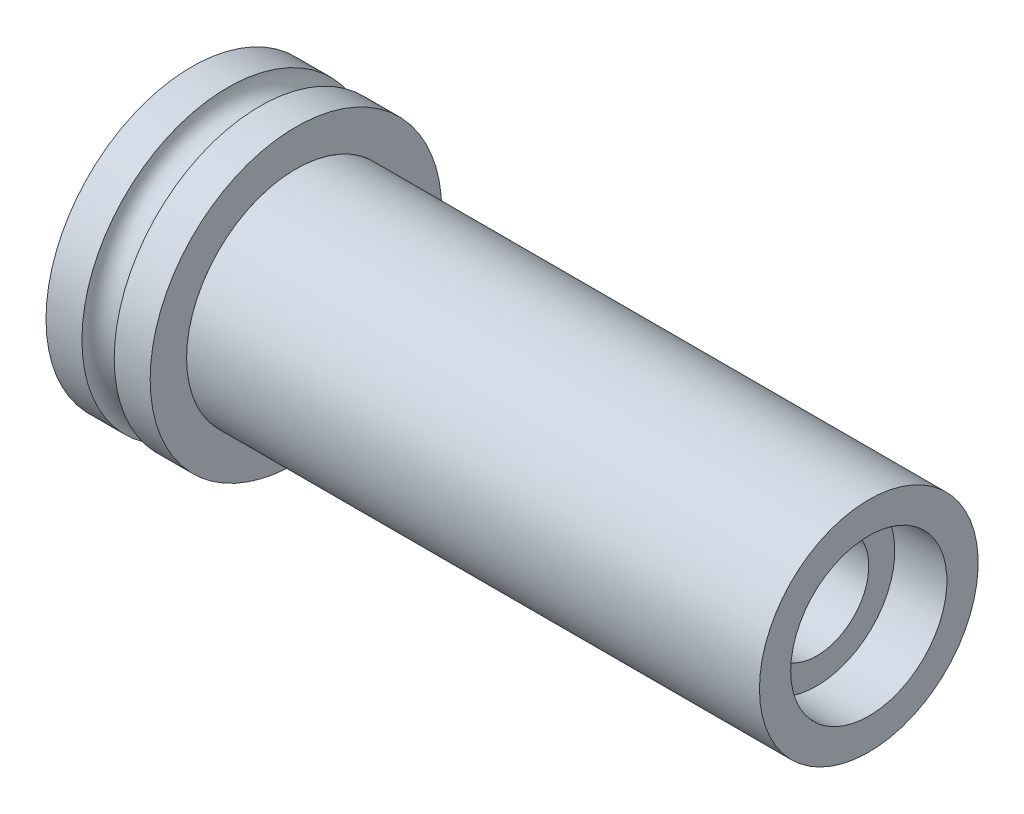
ISO-10303-21;
HEADER;
FILE_DESCRIPTION(('STEP AP214'),'2;1');
FILE_NAME('part.step','',(''),(''),'','','');
FILE_SCHEMA(('AUTOMOTIVE_DESIGN { 1 0 10303 214 1 1 1 1 }'));
ENDSEC;
DATA;
#1=APPLICATION_CONTEXT('core data for automotive mechanical design processes');
#2=APPLICATION_PROTOCOL_DEFINITION('international standard','automotive_design',2000,#1);
#3=PRODUCT_CONTEXT('',#1,'mechanical');
#4=PRODUCT('Part','Part','',(#3));
#5=PRODUCT_RELATED_PRODUCT_CATEGORY('part','',(#4));
#6=PRODUCT_DEFINITION_FORMATION('','',#4);
#7=PRODUCT_DEFINITION_CONTEXT('part definition',#1,'design');
#8=PRODUCT_DEFINITION('design','',#6,#7);
#9=PRODUCT_DEFINITION_SHAPE('','',#8);
#10=(LENGTH_UNIT() NAMED_UNIT(*) SI_UNIT(.MILLI.,.METRE.));
#11=(NAMED_UNIT(*) PLANE_ANGLE_UNIT() SI_UNIT($,.RADIAN.));
#12=(NAMED_UNIT(*) SI_UNIT($,.STERADIAN.) SOLID_ANGLE_UNIT());
#13=UNCERTAINTY_MEASURE_WITH_UNIT(LENGTH_MEASURE(1.E-05),#10,'distance_accuracy_value','');
#14=(GEOMETRIC_REPRESENTATION_CONTEXT(3) GLOBAL_UNCERTAINTY_ASSIGNED_CONTEXT((#13)) GLOBAL_UNIT_ASSIGNED_CONTEXT((#10,
#11,#12)) REPRESENTATION_CONTEXT('',''));
#15=CARTESIAN_POINT('',(0.,0.,0.));
#16=DIRECTION('',(0.,0.,1.));
#17=DIRECTION('',(1.,0.,0.));
#18=AXIS2_PLACEMENT_3D('',#15,#16,#17);
#19=CARTESIAN_POINT('',(-37.5,0.,0.));
#20=DIRECTION('',(1.,0.,0.));
#21=DIRECTION('',(0.,0.,-1.));
#22=AXIS2_PLACEMENT_3D('',#19,#20,#21);
#23=CYLINDRICAL_SURFACE('',#22,14.);
#24=CARTESIAN_POINT('',(-37.5,0.,0.));
#25=DIRECTION('',(1.,0.,0.));
#26=DIRECTION('',(0.,0.,-1.));
#27=AXIS2_PLACEMENT_3D('',#24,#25,#26);
#28=CIRCLE('',#27,14.);
#29=CARTESIAN_POINT('',(-37.5,0.,-14.));
#30=VERTEX_POINT('',#29);
#31=EDGE_CURVE('E11',#30,#30,#28,.T.);
#32=ORIENTED_EDGE('',*,*,#31,.T.);
#33=EDGE_LOOP('',(#32));
#34=FACE_BOUND('',#33,.T.);
#35=CARTESIAN_POINT('',(-34.05,0.,0.));
#36=DIRECTION('',(1.,0.,0.));
#37=DIRECTION('',(0.,0.,-1.));
#38=AXIS2_PLACEMENT_3D('',#35,#36,#37);
#39=CIRCLE('',#38,14.);
#40=CARTESIAN_POINT('',(-34.05,0.,-14.));
#41=VERTEX_POINT('',#40);
#42=EDGE_CURVE('E48',#41,#41,#39,.F.);
#43=ORIENTED_EDGE('',*,*,#42,.T.);
#44=EDGE_LOOP('',(#43));
#45=FACE_BOUND('',#44,.T.);
#46=ADVANCED_FACE('F45',(#34,#45),#23,.T.);
#47=CARTESIAN_POINT('',(-27.5,0.,0.));
#48=DIRECTION('',(1.,0.,0.));
#49=DIRECTION('',(0.,0.,-1.));
#50=AXIS2_PLACEMENT_3D('',#47,#48,#49);
#51=CIRCLE('',#50,14.);
#52=CARTESIAN_POINT('',(-27.5,0.,-14.));
#53=VERTEX_POINT('',#52);
#54=EDGE_CURVE('E52',#53,#53,#51,.T.);
#55=ORIENTED_EDGE('',*,*,#54,.F.);
#56=EDGE_LOOP('',(#55));
#57=FACE_BOUND('',#56,.T.);
#58=CARTESIAN_POINT('',(-30.95,0.,0.));
#59=DIRECTION('',(-1.,0.,0.));
#60=DIRECTION('',(0.,0.,1.));
#61=AXIS2_PLACEMENT_3D('',#58,#59,#60);
#62=CIRCLE('',#61,14.);
#63=CARTESIAN_POINT('',(-30.95,0.,14.));
#64=VERTEX_POINT('',#63);
#65=EDGE_CURVE('E62',#64,#64,#62,.F.);
#66=ORIENTED_EDGE('',*,*,#65,.T.);
#67=EDGE_LOOP('',(#66));
#68=FACE_BOUND('',#67,.T.);
#69=ADVANCED_FACE('F92',(#57,#68),#23,.T.);
#70=CARTESIAN_POINT('',(-37.5,0.,0.));
#71=DIRECTION('',(1.,0.,0.));
#72=DIRECTION('',(0.,0.,-1.));
#73=AXIS2_PLACEMENT_3D('',#70,#71,#72);
#74=PLANE('',#73);
#75=CARTESIAN_POINT('',(-37.5,0.,0.));
#76=DIRECTION('',(1.,0.,0.));
#77=DIRECTION('',(0.,0.,-1.));
#78=AXIS2_PLACEMENT_3D('',#75,#76,#77);
#79=CIRCLE('',#78,10.5);
#80=CARTESIAN_POINT('',(-37.5,0.,-10.5));
#81=VERTEX_POINT('',#80);
#82=EDGE_CURVE('E57',#81,#81,#79,.T.);
#83=ORIENTED_EDGE('',*,*,#82,.T.);
#84=EDGE_LOOP('',(#83));
#85=FACE_BOUND('',#84,.T.);
#86=ORIENTED_EDGE('',*,*,#31,.F.);
#87=EDGE_LOOP('',(#86));
#88=FACE_BOUND('',#87,.T.);
#89=ADVANCED_FACE('F75',(#85,#88),#74,.F.);
#90=CARTESIAN_POINT('',(-27.5,0.,0.));
#91=DIRECTION('',(1.,0.,0.));
#92=DIRECTION('',(0.,0.,-1.));
#93=AXIS2_PLACEMENT_3D('',#90,#91,#92);
#94=PLANE('',#93);
#95=CARTESIAN_POINT('',(-27.5,0.,0.));
#96=DIRECTION('',(1.,0.,0.));
#97=DIRECTION('',(0.,0.,-1.));
#98=AXIS2_PLACEMENT_3D('',#95,#96,#97);
#99=CIRCLE('',#98,10.5);
#100=CARTESIAN_POINT('',(-27.5,0.,-10.5));
#101=VERTEX_POINT('',#100);
#102=EDGE_CURVE('E60',#101,#101,#99,.T.);
#103=ORIENTED_EDGE('',*,*,#102,.F.);
#104=EDGE_LOOP('',(#103));
#105=FACE_BOUND('',#104,.T.);
#106=ORIENTED_EDGE('',*,*,#54,.T.);
#107=EDGE_LOOP('',(#106));
#108=FACE_BOUND('',#107,.T.);
#109=ADVANCED_FACE('F81',(#105,#108),#94,.T.);
#110=CARTESIAN_POINT('',(-37.5,0.,0.));
#111=DIRECTION('',(1.,0.,0.));
#112=DIRECTION('',(0.,0.,-1.));
#113=AXIS2_PLACEMENT_3D('',#110,#111,#112);
#114=CYLINDRICAL_SURFACE('',#113,10.5);
#115=ORIENTED_EDGE('',*,*,#82,.F.);
#116=EDGE_LOOP('',(#115));
#117=FACE_BOUND('',#116,.T.);
#118=ORIENTED_EDGE('',*,*,#102,.T.);
#119=EDGE_LOOP('',(#118));
#120=FACE_BOUND('',#119,.T.);
#121=ADVANCED_FACE('F78',(#117,#120),#114,.F.);
#122=CARTESIAN_POINT('',(-32.5,0.,0.));
#123=DIRECTION('',(-1.,0.,0.));
#124=DIRECTION('',(0.,0.,1.));
#125=AXIS2_PLACEMENT_3D('',#122,#123,#124);
#126=TOROIDAL_SURFACE('',#125,14.,1.55);
#127=ORIENTED_EDGE('',*,*,#42,.F.);
#128=EDGE_LOOP('',(#127));
#129=FACE_BOUND('',#128,.T.);
#130=ORIENTED_EDGE('',*,*,#65,.F.);
#131=EDGE_LOOP('',(#130));
#132=FACE_BOUND('',#131,.T.);
#133=ADVANCED_FACE('F80',(#129,#132),#126,.F.);
#134=CLOSED_SHELL('',(#46,#69,#89,#109,#121,#133));
#135=MANIFOLD_SOLID_BREP('B2',#134);
#136=CARTESIAN_POINT('',(-27.5,0.,0.));
#137=DIRECTION('',(-1.,0.,0.));
#138=DIRECTION('',(0.,0.,1.));
#139=AXIS2_PLACEMENT_3D('',#136,#137,#138);
#140=CYLINDRICAL_SURFACE('',#139,7.5);
#141=CARTESIAN_POINT('',(27.5,0.,0.));
#142=DIRECTION('',(-1.,0.,0.));
#143=DIRECTION('',(0.,0.,1.));
#144=AXIS2_PLACEMENT_3D('',#141,#142,#143);
#145=CIRCLE('',#144,7.5);
#146=CARTESIAN_POINT('',(27.5,0.,7.49999999999999));
#147=VERTEX_POINT('',#146);
#148=EDGE_CURVE('E164',#147,#147,#145,.T.);
#149=ORIENTED_EDGE('',*,*,#148,.F.);
#150=EDGE_LOOP('',(#149));
#151=FACE_BOUND('',#150,.T.);
#152=CARTESIAN_POINT('',(22.5,0.,0.));
#153=DIRECTION('',(-1.,0.,0.));
#154=DIRECTION('',(0.,0.,1.));
#155=AXIS2_PLACEMENT_3D('',#152,#153,#154);
#156=CIRCLE('',#155,7.49999999999999);
#157=CARTESIAN_POINT('',(22.5,0.,7.49999999999998));
#158=VERTEX_POINT('',#157);
#159=EDGE_CURVE('E44',#158,#158,#156,.T.);
#160=ORIENTED_EDGE('',*,*,#159,.T.);
#161=EDGE_LOOP('',(#160));
#162=FACE_BOUND('',#161,.T.);
#163=ADVANCED_FACE('F136',(#151,#162),#140,.F.);
#164=CARTESIAN_POINT('',(22.5,0.,-5.));
#165=DIRECTION('',(-1.,0.,0.));
#166=DIRECTION('',(0.,0.,1.));
#167=AXIS2_PLACEMENT_3D('',#164,#165,#166);
#168=PLANE('',#167);
#169=ORIENTED_EDGE('',*,*,#159,.F.);
#170=EDGE_LOOP('',(#169));
#171=FACE_BOUND('',#170,.T.);
#172=CARTESIAN_POINT('',(22.5,0.,0.));
#173=DIRECTION('',(-1.,0.,0.));
#174=DIRECTION('',(0.,0.,1.));
#175=AXIS2_PLACEMENT_3D('',#172,#173,#174);
#176=CIRCLE('',#175,4.99999999999999);
#177=CARTESIAN_POINT('',(22.5,0.,4.99999999999998));
#178=VERTEX_POINT('',#177);
#179=EDGE_CURVE('E142',#178,#178,#176,.T.);
#180=ORIENTED_EDGE('',*,*,#179,.T.);
#181=EDGE_LOOP('',(#180));
#182=FACE_BOUND('',#181,.T.);
#183=ADVANCED_FACE('F171',(#171,#182),#168,.F.);
#184=CARTESIAN_POINT('',(-27.5,0.,0.));
#185=DIRECTION('',(-1.,0.,0.));
#186=DIRECTION('',(0.,0.,1.));
#187=AXIS2_PLACEMENT_3D('',#184,#185,#186);
#188=CYLINDRICAL_SURFACE('',#187,4.99999999999999);
#189=ORIENTED_EDGE('',*,*,#179,.F.);
#190=EDGE_LOOP('',(#189));
#191=FACE_BOUND('',#190,.T.);
#192=CARTESIAN_POINT('',(-22.5,0.,0.));
#193=DIRECTION('',(-1.,0.,0.));
#194=DIRECTION('',(0.,0.,1.));
#195=AXIS2_PLACEMENT_3D('',#192,#193,#194);
#196=CIRCLE('',#195,5.);
#197=CARTESIAN_POINT('',(-22.5,0.,5.));
#198=VERTEX_POINT('',#197);
#199=EDGE_CURVE('E146',#198,#198,#196,.T.);
#200=ORIENTED_EDGE('',*,*,#199,.T.);
#201=EDGE_LOOP('',(#200));
#202=FACE_BOUND('',#201,.T.);
#203=ADVANCED_FACE('F175',(#191,#202),#188,.F.);
#204=CARTESIAN_POINT('',(-22.5,0.,-7.5));
#205=DIRECTION('',(1.,0.,0.));
#206=DIRECTION('',(0.,0.,-1.));
#207=AXIS2_PLACEMENT_3D('',#204,#205,#206);
#208=PLANE('',#207);
#209=ORIENTED_EDGE('',*,*,#199,.F.);
#210=EDGE_LOOP('',(#209));
#211=FACE_BOUND('',#210,.T.);
#212=CARTESIAN_POINT('',(-22.5,0.,0.));
#213=DIRECTION('',(-1.,0.,0.));
#214=DIRECTION('',(0.,0.,1.));
#215=AXIS2_PLACEMENT_3D('',#212,#213,#214);
#216=CIRCLE('',#215,7.5);
#217=CARTESIAN_POINT('',(-22.5,0.,7.5));
#218=VERTEX_POINT('',#217);
#219=EDGE_CURVE('E150',#218,#218,#216,.T.);
#220=ORIENTED_EDGE('',*,*,#219,.T.);
#221=EDGE_LOOP('',(#220));
#222=FACE_BOUND('',#221,.T.);
#223=ADVANCED_FACE('F180',(#211,#222),#208,.F.);
#224=CARTESIAN_POINT('',(-27.5,0.,0.));
#225=DIRECTION('',(-1.,0.,0.));
#226=DIRECTION('',(0.,0.,1.));
#227=AXIS2_PLACEMENT_3D('',#224,#225,#226);
#228=CYLINDRICAL_SURFACE('',#227,7.5);
#229=ORIENTED_EDGE('',*,*,#219,.F.);
#230=EDGE_LOOP('',(#229));
#231=FACE_BOUND('',#230,.T.);
#232=CARTESIAN_POINT('',(-27.5,0.,0.));
#233=DIRECTION('',(-1.,0.,0.));
#234=DIRECTION('',(0.,0.,1.));
#235=AXIS2_PLACEMENT_3D('',#232,#233,#234);
#236=CIRCLE('',#235,7.5);
#237=CARTESIAN_POINT('',(-27.5,0.,7.5));
#238=VERTEX_POINT('',#237);
#239=EDGE_CURVE('E155',#238,#238,#236,.T.);
#240=ORIENTED_EDGE('',*,*,#239,.T.);
#241=EDGE_LOOP('',(#240));
#242=FACE_BOUND('',#241,.T.);
#243=ADVANCED_FACE('F186',(#231,#242),#228,.F.);
#244=CARTESIAN_POINT('',(-27.5,0.,-10.5));
#245=DIRECTION('',(1.,0.,0.));
#246=DIRECTION('',(0.,0.,-1.));
#247=AXIS2_PLACEMENT_3D('',#244,#245,#246);
#248=PLANE('',#247);
#249=ORIENTED_EDGE('',*,*,#239,.F.);
#250=EDGE_LOOP('',(#249));
#251=FACE_BOUND('',#250,.T.);
#252=CARTESIAN_POINT('',(-27.5,0.,0.));
#253=DIRECTION('',(-1.,0.,0.));
#254=DIRECTION('',(0.,0.,1.));
#255=AXIS2_PLACEMENT_3D('',#252,#253,#254);
#256=CIRCLE('',#255,10.5);
#257=CARTESIAN_POINT('',(-27.5,0.,10.5));
#258=VERTEX_POINT('',#257);
#259=EDGE_CURVE('E158',#258,#258,#256,.T.);
#260=ORIENTED_EDGE('',*,*,#259,.T.);
#261=EDGE_LOOP('',(#260));
#262=FACE_BOUND('',#261,.T.);
#263=ADVANCED_FACE('F190',(#251,#262),#248,.F.);
#264=CARTESIAN_POINT('',(-27.5,0.,0.));
#265=DIRECTION('',(-1.,0.,0.));
#266=DIRECTION('',(0.,0.,1.));
#267=AXIS2_PLACEMENT_3D('',#264,#265,#266);
#268=CYLINDRICAL_SURFACE('',#267,10.5);
#269=ORIENTED_EDGE('',*,*,#259,.F.);
#270=EDGE_LOOP('',(#269));
#271=FACE_BOUND('',#270,.T.);
#272=CARTESIAN_POINT('',(27.5,0.,0.));
#273=DIRECTION('',(-1.,0.,0.));
#274=DIRECTION('',(0.,0.,1.));
#275=AXIS2_PLACEMENT_3D('',#272,#273,#274);
#276=CIRCLE('',#275,10.5);
#277=CARTESIAN_POINT('',(27.5,0.,10.5));
#278=VERTEX_POINT('',#277);
#279=EDGE_CURVE('E161',#278,#278,#276,.T.);
#280=ORIENTED_EDGE('',*,*,#279,.T.);
#281=EDGE_LOOP('',(#280));
#282=FACE_BOUND('',#281,.T.);
#283=ADVANCED_FACE('F194',(#271,#282),#268,.T.);
#284=CARTESIAN_POINT('',(27.5,0.,-10.5));
#285=DIRECTION('',(-1.,0.,0.));
#286=DIRECTION('',(0.,0.,1.));
#287=AXIS2_PLACEMENT_3D('',#284,#285,#286);
#288=PLANE('',#287);
#289=ORIENTED_EDGE('',*,*,#279,.F.);
#290=EDGE_LOOP('',(#289));
#291=FACE_BOUND('',#290,.T.);
#292=ORIENTED_EDGE('',*,*,#148,.T.);
#293=EDGE_LOOP('',(#292));
#294=FACE_BOUND('',#293,.T.);
#295=ADVANCED_FACE('F168',(#291,#294),#288,.F.);
#296=CLOSED_SHELL('',(#163,#183,#203,#223,#243,#263,#283,#295));
#297=MANIFOLD_SOLID_BREP('B6',#296);
#298=ADVANCED_BREP_SHAPE_REPRESENTATION('',(#18,#135,#297),#14);
#299=SHAPE_DEFINITION_REPRESENTATION(#9,#298);
ENDSEC;
END-ISO-10303-21;
